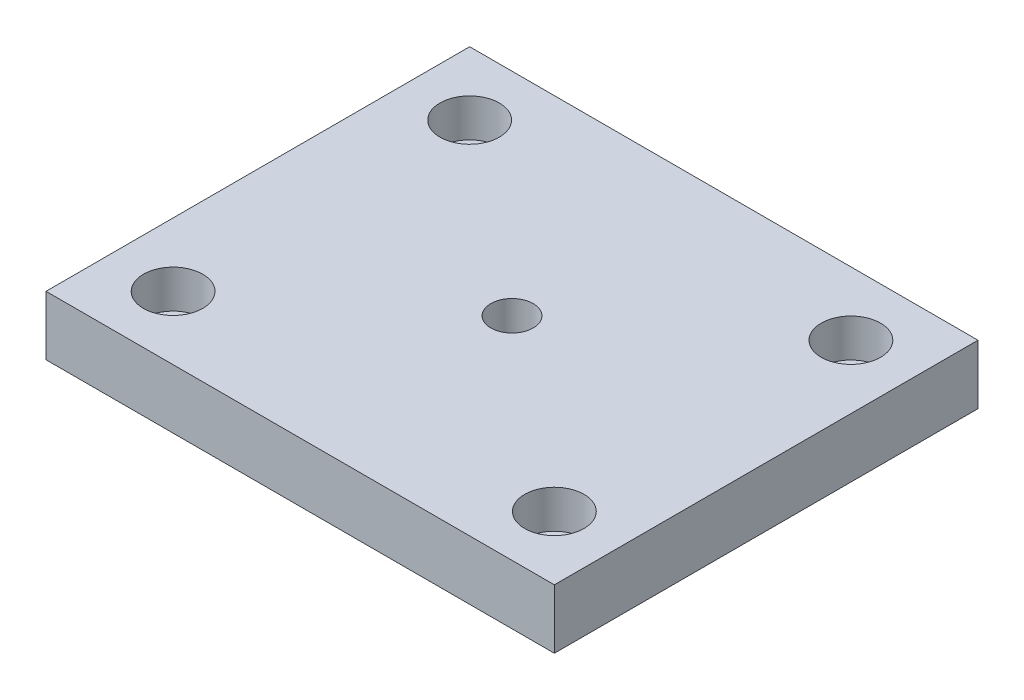
ISO-10303-21;
HEADER;
FILE_DESCRIPTION(('STEP AP214'),'2;1');
FILE_NAME('part.step','',(''),(''),'','','');
FILE_SCHEMA(('AUTOMOTIVE_DESIGN { 1 0 10303 214 1 1 1 1 }'));
ENDSEC;
DATA;
#1=APPLICATION_CONTEXT('core data for automotive mechanical design processes');
#2=APPLICATION_PROTOCOL_DEFINITION('international standard','automotive_design',2000,#1);
#3=PRODUCT_CONTEXT('',#1,'mechanical');
#4=PRODUCT('Part','Part','',(#3));
#5=PRODUCT_RELATED_PRODUCT_CATEGORY('part','',(#4));
#6=PRODUCT_DEFINITION_FORMATION('','',#4);
#7=PRODUCT_DEFINITION_CONTEXT('part definition',#1,'design');
#8=PRODUCT_DEFINITION('design','',#6,#7);
#9=PRODUCT_DEFINITION_SHAPE('','',#8);
#10=(LENGTH_UNIT() NAMED_UNIT(*) SI_UNIT(.MILLI.,.METRE.));
#11=(NAMED_UNIT(*) PLANE_ANGLE_UNIT() SI_UNIT($,.RADIAN.));
#12=(NAMED_UNIT(*) SI_UNIT($,.STERADIAN.) SOLID_ANGLE_UNIT());
#13=UNCERTAINTY_MEASURE_WITH_UNIT(LENGTH_MEASURE(1.E-05),#10,'distance_accuracy_value','');
#14=(GEOMETRIC_REPRESENTATION_CONTEXT(3) GLOBAL_UNCERTAINTY_ASSIGNED_CONTEXT((#13)) GLOBAL_UNIT_ASSIGNED_CONTEXT((#10,
#11,#12)) REPRESENTATION_CONTEXT('',''));
#15=CARTESIAN_POINT('',(0.,0.,0.));
#16=DIRECTION('',(0.,0.,1.));
#17=DIRECTION('',(1.,0.,0.));
#18=AXIS2_PLACEMENT_3D('',#15,#16,#17);
#19=CARTESIAN_POINT('',(60.,14.,-50.));
#20=DIRECTION('',(0.,-1.,0.));
#21=DIRECTION('',(0.,0.,-1.));
#22=AXIS2_PLACEMENT_3D('',#19,#20,#21);
#23=PLANE('',#22);
#24=CARTESIAN_POINT('',(-45.,14.,-35.));
#25=DIRECTION('',(0.,1.,0.));
#26=DIRECTION('',(0.,0.,1.));
#27=AXIS2_PLACEMENT_3D('',#24,#25,#26);
#28=CIRCLE('',#27,7.);
#29=CARTESIAN_POINT('',(-45.,14.,-28.));
#30=VERTEX_POINT('',#29);
#31=EDGE_CURVE('E163',#30,#30,#28,.T.);
#32=ORIENTED_EDGE('',*,*,#31,.F.);
#33=EDGE_LOOP('',(#32));
#34=FACE_BOUND('',#33,.T.);
#35=CARTESIAN_POINT('',(-45.,14.,35.));
#36=DIRECTION('',(0.,1.,0.));
#37=DIRECTION('',(0.,0.,1.));
#38=AXIS2_PLACEMENT_3D('',#35,#36,#37);
#39=CIRCLE('',#38,7.);
#40=CARTESIAN_POINT('',(-45.,14.,42.));
#41=VERTEX_POINT('',#40);
#42=EDGE_CURVE('E151',#41,#41,#39,.T.);
#43=ORIENTED_EDGE('',*,*,#42,.F.);
#44=EDGE_LOOP('',(#43));
#45=FACE_BOUND('',#44,.T.);
#46=CARTESIAN_POINT('',(45.,14.,35.));
#47=DIRECTION('',(0.,1.,0.));
#48=DIRECTION('',(0.,0.,1.));
#49=AXIS2_PLACEMENT_3D('',#46,#47,#48);
#50=CIRCLE('',#49,7.);
#51=CARTESIAN_POINT('',(45.,14.,42.));
#52=VERTEX_POINT('',#51);
#53=EDGE_CURVE('E139',#52,#52,#50,.T.);
#54=ORIENTED_EDGE('',*,*,#53,.F.);
#55=EDGE_LOOP('',(#54));
#56=FACE_BOUND('',#55,.T.);
#57=CARTESIAN_POINT('',(45.,14.,-35.));
#58=DIRECTION('',(0.,1.,0.));
#59=DIRECTION('',(0.,0.,1.));
#60=AXIS2_PLACEMENT_3D('',#57,#58,#59);
#61=CIRCLE('',#60,7.);
#62=CARTESIAN_POINT('',(45.,14.,-28.));
#63=VERTEX_POINT('',#62);
#64=EDGE_CURVE('E127',#63,#63,#61,.T.);
#65=ORIENTED_EDGE('',*,*,#64,.F.);
#66=EDGE_LOOP('',(#65));
#67=FACE_BOUND('',#66,.T.);
#68=DIRECTION('',(0.,0.,-1.));
#69=VECTOR('',#68,1.);
#70=CARTESIAN_POINT('',(60.,14.,50.));
#71=LINE('',#70,#69);
#72=CARTESIAN_POINT('',(60.,14.,50.));
#73=VERTEX_POINT('',#72);
#74=CARTESIAN_POINT('',(60.,14.,-50.));
#75=VERTEX_POINT('',#74);
#76=EDGE_CURVE('E86',#73,#75,#71,.T.);
#77=ORIENTED_EDGE('',*,*,#76,.T.);
#78=DIRECTION('',(-1.,0.,0.));
#79=VECTOR('',#78,1.);
#80=CARTESIAN_POINT('',(-60.,14.,-50.));
#81=LINE('',#80,#79);
#82=CARTESIAN_POINT('',(-60.,14.,-50.));
#83=VERTEX_POINT('',#82);
#84=EDGE_CURVE('E81',#75,#83,#81,.T.);
#85=ORIENTED_EDGE('',*,*,#84,.T.);
#86=DIRECTION('',(0.,0.,1.));
#87=VECTOR('',#86,1.);
#88=CARTESIAN_POINT('',(-60.,14.,50.));
#89=LINE('',#88,#87);
#90=CARTESIAN_POINT('',(-60.,14.,50.));
#91=VERTEX_POINT('',#90);
#92=EDGE_CURVE('E84',#83,#91,#89,.T.);
#93=ORIENTED_EDGE('',*,*,#92,.T.);
#94=DIRECTION('',(1.,0.,0.));
#95=VECTOR('',#94,1.);
#96=CARTESIAN_POINT('',(-60.,14.,50.));
#97=LINE('',#96,#95);
#98=EDGE_CURVE('E51',#91,#73,#97,.T.);
#99=ORIENTED_EDGE('',*,*,#98,.T.);
#100=EDGE_LOOP('',(#77,#85,#93,#99));
#101=FACE_BOUND('',#100,.T.);
#102=CARTESIAN_POINT('',(0.,14.,0.));
#103=DIRECTION('',(0.,1.,0.));
#104=DIRECTION('',(0.,0.,1.));
#105=AXIS2_PLACEMENT_3D('',#102,#103,#104);
#106=CIRCLE('',#105,5.);
#107=CARTESIAN_POINT('',(0.,14.,5.));
#108=VERTEX_POINT('',#107);
#109=EDGE_CURVE('E101',#108,#108,#106,.T.);
#110=ORIENTED_EDGE('',*,*,#109,.F.);
#111=EDGE_LOOP('',(#110));
#112=FACE_BOUND('',#111,.T.);
#113=ADVANCED_FACE('F34',(#34,#45,#56,#67,#101,#112),#23,.F.);
#114=CARTESIAN_POINT('',(60.,0.,-50.));
#115=DIRECTION('',(0.,-1.,0.));
#116=DIRECTION('',(0.,0.,-1.));
#117=AXIS2_PLACEMENT_3D('',#114,#115,#116);
#118=PLANE('',#117);
#119=CARTESIAN_POINT('',(-45.,0.,-35.));
#120=DIRECTION('',(0.,1.,0.));
#121=DIRECTION('',(0.,0.,1.));
#122=AXIS2_PLACEMENT_3D('',#119,#120,#121);
#123=CIRCLE('',#122,4.5);
#124=CARTESIAN_POINT('',(-45.,0.,-30.5));
#125=VERTEX_POINT('',#124);
#126=EDGE_CURVE('E154',#125,#125,#123,.T.);
#127=ORIENTED_EDGE('',*,*,#126,.T.);
#128=EDGE_LOOP('',(#127));
#129=FACE_BOUND('',#128,.T.);
#130=CARTESIAN_POINT('',(-45.,0.,35.));
#131=DIRECTION('',(0.,1.,0.));
#132=DIRECTION('',(0.,0.,1.));
#133=AXIS2_PLACEMENT_3D('',#130,#131,#132);
#134=CIRCLE('',#133,4.5);
#135=CARTESIAN_POINT('',(-45.,0.,39.5));
#136=VERTEX_POINT('',#135);
#137=EDGE_CURVE('E142',#136,#136,#134,.T.);
#138=ORIENTED_EDGE('',*,*,#137,.T.);
#139=EDGE_LOOP('',(#138));
#140=FACE_BOUND('',#139,.T.);
#141=CARTESIAN_POINT('',(45.,0.,35.));
#142=DIRECTION('',(0.,1.,0.));
#143=DIRECTION('',(0.,0.,1.));
#144=AXIS2_PLACEMENT_3D('',#141,#142,#143);
#145=CIRCLE('',#144,4.5);
#146=CARTESIAN_POINT('',(45.,0.,39.5));
#147=VERTEX_POINT('',#146);
#148=EDGE_CURVE('E130',#147,#147,#145,.T.);
#149=ORIENTED_EDGE('',*,*,#148,.T.);
#150=EDGE_LOOP('',(#149));
#151=FACE_BOUND('',#150,.T.);
#152=CARTESIAN_POINT('',(45.,0.,-35.));
#153=DIRECTION('',(0.,1.,0.));
#154=DIRECTION('',(0.,0.,1.));
#155=AXIS2_PLACEMENT_3D('',#152,#153,#154);
#156=CIRCLE('',#155,4.5);
#157=CARTESIAN_POINT('',(45.,0.,-30.5));
#158=VERTEX_POINT('',#157);
#159=EDGE_CURVE('E116',#158,#158,#156,.T.);
#160=ORIENTED_EDGE('',*,*,#159,.T.);
#161=EDGE_LOOP('',(#160));
#162=FACE_BOUND('',#161,.T.);
#163=DIRECTION('',(0.,0.,-1.));
#164=VECTOR('',#163,1.);
#165=CARTESIAN_POINT('',(60.,0.,50.));
#166=LINE('',#165,#164);
#167=CARTESIAN_POINT('',(60.,0.,50.));
#168=VERTEX_POINT('',#167);
#169=CARTESIAN_POINT('',(60.,0.,-50.));
#170=VERTEX_POINT('',#169);
#171=EDGE_CURVE('E98',#168,#170,#166,.T.);
#172=ORIENTED_EDGE('',*,*,#171,.F.);
#173=DIRECTION('',(1.,0.,0.));
#174=VECTOR('',#173,1.);
#175=CARTESIAN_POINT('',(-60.,0.,50.));
#176=LINE('',#175,#174);
#177=CARTESIAN_POINT('',(-60.,0.,50.));
#178=VERTEX_POINT('',#177);
#179=EDGE_CURVE('E74',#178,#168,#176,.T.);
#180=ORIENTED_EDGE('',*,*,#179,.F.);
#181=DIRECTION('',(0.,0.,1.));
#182=VECTOR('',#181,1.);
#183=CARTESIAN_POINT('',(-60.,0.,50.));
#184=LINE('',#183,#182);
#185=CARTESIAN_POINT('',(-60.,0.,-50.));
#186=VERTEX_POINT('',#185);
#187=EDGE_CURVE('E68',#186,#178,#184,.T.);
#188=ORIENTED_EDGE('',*,*,#187,.F.);
#189=DIRECTION('',(-1.,0.,0.));
#190=VECTOR('',#189,1.);
#191=CARTESIAN_POINT('',(-60.,0.,-50.));
#192=LINE('',#191,#190);
#193=EDGE_CURVE('E90',#170,#186,#192,.T.);
#194=ORIENTED_EDGE('',*,*,#193,.F.);
#195=EDGE_LOOP('',(#172,#180,#188,#194));
#196=FACE_BOUND('',#195,.T.);
#197=CARTESIAN_POINT('',(0.,0.,0.));
#198=DIRECTION('',(0.,1.,0.));
#199=DIRECTION('',(0.,0.,1.));
#200=AXIS2_PLACEMENT_3D('',#197,#198,#199);
#201=CIRCLE('',#200,5.);
#202=CARTESIAN_POINT('',(0.,0.,5.));
#203=VERTEX_POINT('',#202);
#204=EDGE_CURVE('E113',#203,#203,#201,.T.);
#205=ORIENTED_EDGE('',*,*,#204,.T.);
#206=EDGE_LOOP('',(#205));
#207=FACE_BOUND('',#206,.T.);
#208=ADVANCED_FACE('F109',(#129,#140,#151,#162,#196,#207),#118,.T.);
#209=CARTESIAN_POINT('',(60.,14.,50.));
#210=DIRECTION('',(-1.,0.,0.));
#211=DIRECTION('',(0.,0.,1.));
#212=AXIS2_PLACEMENT_3D('',#209,#210,#211);
#213=PLANE('',#212);
#214=ORIENTED_EDGE('',*,*,#171,.T.);
#215=DIRECTION('',(0.,-1.,0.));
#216=VECTOR('',#215,1.);
#217=CARTESIAN_POINT('',(60.,14.,-50.));
#218=LINE('',#217,#216);
#219=EDGE_CURVE('E11',#75,#170,#218,.T.);
#220=ORIENTED_EDGE('',*,*,#219,.F.);
#221=ORIENTED_EDGE('',*,*,#76,.F.);
#222=DIRECTION('',(0.,-1.,0.));
#223=VECTOR('',#222,1.);
#224=CARTESIAN_POINT('',(60.,14.,50.));
#225=LINE('',#224,#223);
#226=EDGE_CURVE('E94',#73,#168,#225,.T.);
#227=ORIENTED_EDGE('',*,*,#226,.T.);
#228=EDGE_LOOP('',(#214,#220,#221,#227));
#229=FACE_BOUND('',#228,.T.);
#230=ADVANCED_FACE('F36',(#229),#213,.F.);
#231=CARTESIAN_POINT('',(-60.,14.,-50.));
#232=DIRECTION('',(0.,0.,1.));
#233=DIRECTION('',(1.,0.,0.));
#234=AXIS2_PLACEMENT_3D('',#231,#232,#233);
#235=PLANE('',#234);
#236=ORIENTED_EDGE('',*,*,#193,.T.);
#237=DIRECTION('',(0.,-1.,0.));
#238=VECTOR('',#237,1.);
#239=CARTESIAN_POINT('',(-60.,14.,-50.));
#240=LINE('',#239,#238);
#241=EDGE_CURVE('E43',#83,#186,#240,.T.);
#242=ORIENTED_EDGE('',*,*,#241,.F.);
#243=ORIENTED_EDGE('',*,*,#84,.F.);
#244=ORIENTED_EDGE('',*,*,#219,.T.);
#245=EDGE_LOOP('',(#236,#242,#243,#244));
#246=FACE_BOUND('',#245,.T.);
#247=ADVANCED_FACE('F89',(#246),#235,.F.);
#248=CARTESIAN_POINT('',(-60.,14.,50.));
#249=DIRECTION('',(1.,0.,0.));
#250=DIRECTION('',(0.,0.,-1.));
#251=AXIS2_PLACEMENT_3D('',#248,#249,#250);
#252=PLANE('',#251);
#253=ORIENTED_EDGE('',*,*,#187,.T.);
#254=DIRECTION('',(0.,-1.,0.));
#255=VECTOR('',#254,1.);
#256=CARTESIAN_POINT('',(-60.,14.,50.));
#257=LINE('',#256,#255);
#258=EDGE_CURVE('E91',#91,#178,#257,.T.);
#259=ORIENTED_EDGE('',*,*,#258,.F.);
#260=ORIENTED_EDGE('',*,*,#92,.F.);
#261=ORIENTED_EDGE('',*,*,#241,.T.);
#262=EDGE_LOOP('',(#253,#259,#260,#261));
#263=FACE_BOUND('',#262,.T.);
#264=ADVANCED_FACE('F92',(#263),#252,.F.);
#265=CARTESIAN_POINT('',(-60.,14.,50.));
#266=DIRECTION('',(0.,0.,-1.));
#267=DIRECTION('',(-1.,0.,0.));
#268=AXIS2_PLACEMENT_3D('',#265,#266,#267);
#269=PLANE('',#268);
#270=ORIENTED_EDGE('',*,*,#179,.T.);
#271=ORIENTED_EDGE('',*,*,#226,.F.);
#272=ORIENTED_EDGE('',*,*,#98,.F.);
#273=ORIENTED_EDGE('',*,*,#258,.T.);
#274=EDGE_LOOP('',(#270,#271,#272,#273));
#275=FACE_BOUND('',#274,.T.);
#276=ADVANCED_FACE('F106',(#275),#269,.F.);
#277=CARTESIAN_POINT('',(0.,14.,0.));
#278=DIRECTION('',(0.,-1.,0.));
#279=DIRECTION('',(0.,0.,-1.));
#280=AXIS2_PLACEMENT_3D('',#277,#278,#279);
#281=CYLINDRICAL_SURFACE('',#280,5.);
#282=ORIENTED_EDGE('',*,*,#109,.T.);
#283=EDGE_LOOP('',(#282));
#284=FACE_BOUND('',#283,.T.);
#285=ORIENTED_EDGE('',*,*,#204,.F.);
#286=EDGE_LOOP('',(#285));
#287=FACE_BOUND('',#286,.T.);
#288=ADVANCED_FACE('F199',(#284,#287),#281,.F.);
#289=CARTESIAN_POINT('',(45.,14.,-35.));
#290=DIRECTION('',(0.,1.,0.));
#291=DIRECTION('',(0.,0.,1.));
#292=AXIS2_PLACEMENT_3D('',#289,#290,#291);
#293=CYLINDRICAL_SURFACE('',#292,4.5);
#294=ORIENTED_EDGE('',*,*,#159,.F.);
#295=EDGE_LOOP('',(#294));
#296=FACE_BOUND('',#295,.T.);
#297=CARTESIAN_POINT('',(45.,5.,-35.));
#298=DIRECTION('',(0.,1.,0.));
#299=DIRECTION('',(0.,0.,1.));
#300=AXIS2_PLACEMENT_3D('',#297,#298,#299);
#301=CIRCLE('',#300,4.5);
#302=CARTESIAN_POINT('',(45.,5.,-30.5));
#303=VERTEX_POINT('',#302);
#304=EDGE_CURVE('E121',#303,#303,#301,.T.);
#305=ORIENTED_EDGE('',*,*,#304,.T.);
#306=EDGE_LOOP('',(#305));
#307=FACE_BOUND('',#306,.T.);
#308=ADVANCED_FACE('F191',(#296,#307),#293,.F.);
#309=CARTESIAN_POINT('',(49.5,5.,-35.));
#310=DIRECTION('',(0.,-1.,0.));
#311=DIRECTION('',(0.,0.,-1.));
#312=AXIS2_PLACEMENT_3D('',#309,#310,#311);
#313=PLANE('',#312);
#314=ORIENTED_EDGE('',*,*,#304,.F.);
#315=EDGE_LOOP('',(#314));
#316=FACE_BOUND('',#315,.T.);
#317=CARTESIAN_POINT('',(45.,5.,-35.));
#318=DIRECTION('',(0.,1.,0.));
#319=DIRECTION('',(0.,0.,1.));
#320=AXIS2_PLACEMENT_3D('',#317,#318,#319);
#321=CIRCLE('',#320,7.);
#322=CARTESIAN_POINT('',(45.,5.,-28.));
#323=VERTEX_POINT('',#322);
#324=EDGE_CURVE('E124',#323,#323,#321,.T.);
#325=ORIENTED_EDGE('',*,*,#324,.T.);
#326=EDGE_LOOP('',(#325));
#327=FACE_BOUND('',#326,.T.);
#328=ADVANCED_FACE('F181',(#316,#327),#313,.F.);
#329=CARTESIAN_POINT('',(45.,14.,-35.));
#330=DIRECTION('',(0.,1.,0.));
#331=DIRECTION('',(0.,0.,1.));
#332=AXIS2_PLACEMENT_3D('',#329,#330,#331);
#333=CYLINDRICAL_SURFACE('',#332,7.);
#334=ORIENTED_EDGE('',*,*,#324,.F.);
#335=EDGE_LOOP('',(#334));
#336=FACE_BOUND('',#335,.T.);
#337=ORIENTED_EDGE('',*,*,#64,.T.);
#338=EDGE_LOOP('',(#337));
#339=FACE_BOUND('',#338,.T.);
#340=ADVANCED_FACE('F178',(#336,#339),#333,.F.);
#341=CARTESIAN_POINT('',(45.,14.,35.));
#342=DIRECTION('',(0.,1.,0.));
#343=DIRECTION('',(0.,0.,1.));
#344=AXIS2_PLACEMENT_3D('',#341,#342,#343);
#345=CYLINDRICAL_SURFACE('',#344,4.5);
#346=ORIENTED_EDGE('',*,*,#148,.F.);
#347=EDGE_LOOP('',(#346));
#348=FACE_BOUND('',#347,.T.);
#349=CARTESIAN_POINT('',(45.,5.,35.));
#350=DIRECTION('',(0.,1.,0.));
#351=DIRECTION('',(0.,0.,1.));
#352=AXIS2_PLACEMENT_3D('',#349,#350,#351);
#353=CIRCLE('',#352,4.5);
#354=CARTESIAN_POINT('',(45.,5.,39.5));
#355=VERTEX_POINT('',#354);
#356=EDGE_CURVE('E133',#355,#355,#353,.T.);
#357=ORIENTED_EDGE('',*,*,#356,.T.);
#358=EDGE_LOOP('',(#357));
#359=FACE_BOUND('',#358,.T.);
#360=ADVANCED_FACE('F180',(#348,#359),#345,.F.);
#361=CARTESIAN_POINT('',(49.5,5.,35.));
#362=DIRECTION('',(0.,-1.,0.));
#363=DIRECTION('',(0.,0.,-1.));
#364=AXIS2_PLACEMENT_3D('',#361,#362,#363);
#365=PLANE('',#364);
#366=ORIENTED_EDGE('',*,*,#356,.F.);
#367=EDGE_LOOP('',(#366));
#368=FACE_BOUND('',#367,.T.);
#369=CARTESIAN_POINT('',(45.,5.,35.));
#370=DIRECTION('',(0.,1.,0.));
#371=DIRECTION('',(0.,0.,1.));
#372=AXIS2_PLACEMENT_3D('',#369,#370,#371);
#373=CIRCLE('',#372,7.);
#374=CARTESIAN_POINT('',(45.,5.,42.));
#375=VERTEX_POINT('',#374);
#376=EDGE_CURVE('E136',#375,#375,#373,.T.);
#377=ORIENTED_EDGE('',*,*,#376,.T.);
#378=EDGE_LOOP('',(#377));
#379=FACE_BOUND('',#378,.T.);
#380=ADVANCED_FACE('F188',(#368,#379),#365,.F.);
#381=CARTESIAN_POINT('',(45.,14.,35.));
#382=DIRECTION('',(0.,1.,0.));
#383=DIRECTION('',(0.,0.,1.));
#384=AXIS2_PLACEMENT_3D('',#381,#382,#383);
#385=CYLINDRICAL_SURFACE('',#384,7.);
#386=ORIENTED_EDGE('',*,*,#376,.F.);
#387=EDGE_LOOP('',(#386));
#388=FACE_BOUND('',#387,.T.);
#389=ORIENTED_EDGE('',*,*,#53,.T.);
#390=EDGE_LOOP('',(#389));
#391=FACE_BOUND('',#390,.T.);
#392=ADVANCED_FACE('F279',(#388,#391),#385,.F.);
#393=CARTESIAN_POINT('',(-45.,14.,35.));
#394=DIRECTION('',(0.,1.,0.));
#395=DIRECTION('',(0.,0.,1.));
#396=AXIS2_PLACEMENT_3D('',#393,#394,#395);
#397=CYLINDRICAL_SURFACE('',#396,4.5);
#398=ORIENTED_EDGE('',*,*,#137,.F.);
#399=EDGE_LOOP('',(#398));
#400=FACE_BOUND('',#399,.T.);
#401=CARTESIAN_POINT('',(-45.,5.,35.));
#402=DIRECTION('',(0.,1.,0.));
#403=DIRECTION('',(0.,0.,1.));
#404=AXIS2_PLACEMENT_3D('',#401,#402,#403);
#405=CIRCLE('',#404,4.5);
#406=CARTESIAN_POINT('',(-45.,5.,39.5));
#407=VERTEX_POINT('',#406);
#408=EDGE_CURVE('E145',#407,#407,#405,.T.);
#409=ORIENTED_EDGE('',*,*,#408,.T.);
#410=EDGE_LOOP('',(#409));
#411=FACE_BOUND('',#410,.T.);
#412=ADVANCED_FACE('F288',(#400,#411),#397,.F.);
#413=CARTESIAN_POINT('',(-40.5,5.,35.));
#414=DIRECTION('',(0.,-1.,0.));
#415=DIRECTION('',(0.,0.,-1.));
#416=AXIS2_PLACEMENT_3D('',#413,#414,#415);
#417=PLANE('',#416);
#418=ORIENTED_EDGE('',*,*,#408,.F.);
#419=EDGE_LOOP('',(#418));
#420=FACE_BOUND('',#419,.T.);
#421=CARTESIAN_POINT('',(-45.,5.,35.));
#422=DIRECTION('',(0.,1.,0.));
#423=DIRECTION('',(0.,0.,1.));
#424=AXIS2_PLACEMENT_3D('',#421,#422,#423);
#425=CIRCLE('',#424,7.);
#426=CARTESIAN_POINT('',(-45.,5.,42.));
#427=VERTEX_POINT('',#426);
#428=EDGE_CURVE('E148',#427,#427,#425,.T.);
#429=ORIENTED_EDGE('',*,*,#428,.T.);
#430=EDGE_LOOP('',(#429));
#431=FACE_BOUND('',#430,.T.);
#432=ADVANCED_FACE('F298',(#420,#431),#417,.F.);
#433=CARTESIAN_POINT('',(-45.,14.,35.));
#434=DIRECTION('',(0.,1.,0.));
#435=DIRECTION('',(0.,0.,1.));
#436=AXIS2_PLACEMENT_3D('',#433,#434,#435);
#437=CYLINDRICAL_SURFACE('',#436,7.);
#438=ORIENTED_EDGE('',*,*,#428,.F.);
#439=EDGE_LOOP('',(#438));
#440=FACE_BOUND('',#439,.T.);
#441=ORIENTED_EDGE('',*,*,#42,.T.);
#442=EDGE_LOOP('',(#441));
#443=FACE_BOUND('',#442,.T.);
#444=ADVANCED_FACE('F308',(#440,#443),#437,.F.);
#445=CARTESIAN_POINT('',(-45.,14.,-35.));
#446=DIRECTION('',(0.,1.,0.));
#447=DIRECTION('',(0.,0.,1.));
#448=AXIS2_PLACEMENT_3D('',#445,#446,#447);
#449=CYLINDRICAL_SURFACE('',#448,4.5);
#450=ORIENTED_EDGE('',*,*,#126,.F.);
#451=EDGE_LOOP('',(#450));
#452=FACE_BOUND('',#451,.T.);
#453=CARTESIAN_POINT('',(-45.,5.,-35.));
#454=DIRECTION('',(0.,1.,0.));
#455=DIRECTION('',(0.,0.,1.));
#456=AXIS2_PLACEMENT_3D('',#453,#454,#455);
#457=CIRCLE('',#456,4.5);
#458=CARTESIAN_POINT('',(-45.,5.,-30.5));
#459=VERTEX_POINT('',#458);
#460=EDGE_CURVE('E157',#459,#459,#457,.T.);
#461=ORIENTED_EDGE('',*,*,#460,.T.);
#462=EDGE_LOOP('',(#461));
#463=FACE_BOUND('',#462,.T.);
#464=ADVANCED_FACE('F318',(#452,#463),#449,.F.);
#465=CARTESIAN_POINT('',(-40.5,5.,-35.));
#466=DIRECTION('',(0.,-1.,0.));
#467=DIRECTION('',(0.,0.,-1.));
#468=AXIS2_PLACEMENT_3D('',#465,#466,#467);
#469=PLANE('',#468);
#470=ORIENTED_EDGE('',*,*,#460,.F.);
#471=EDGE_LOOP('',(#470));
#472=FACE_BOUND('',#471,.T.);
#473=CARTESIAN_POINT('',(-45.,5.,-35.));
#474=DIRECTION('',(0.,1.,0.));
#475=DIRECTION('',(0.,0.,1.));
#476=AXIS2_PLACEMENT_3D('',#473,#474,#475);
#477=CIRCLE('',#476,7.);
#478=CARTESIAN_POINT('',(-45.,5.,-28.));
#479=VERTEX_POINT('',#478);
#480=EDGE_CURVE('E160',#479,#479,#477,.T.);
#481=ORIENTED_EDGE('',*,*,#480,.T.);
#482=EDGE_LOOP('',(#481));
#483=FACE_BOUND('',#482,.T.);
#484=ADVANCED_FACE('F328',(#472,#483),#469,.F.);
#485=CARTESIAN_POINT('',(-45.,14.,-35.));
#486=DIRECTION('',(0.,1.,0.));
#487=DIRECTION('',(0.,0.,1.));
#488=AXIS2_PLACEMENT_3D('',#485,#486,#487);
#489=CYLINDRICAL_SURFACE('',#488,7.);
#490=ORIENTED_EDGE('',*,*,#480,.F.);
#491=EDGE_LOOP('',(#490));
#492=FACE_BOUND('',#491,.T.);
#493=ORIENTED_EDGE('',*,*,#31,.T.);
#494=EDGE_LOOP('',(#493));
#495=FACE_BOUND('',#494,.T.);
#496=ADVANCED_FACE('F167',(#492,#495),#489,.F.);
#497=CLOSED_SHELL('',(#113,#208,#230,#247,#264,#276,#288,#308,#328,#340,#360,#380,#392,#412,
#432,#444,#464,#484,#496));
#498=MANIFOLD_SOLID_BREP('B2',#497);
#499=ADVANCED_BREP_SHAPE_REPRESENTATION('',(#18,#498),#14);
#500=SHAPE_DEFINITION_REPRESENTATION(#9,#499);
ENDSEC;
END-ISO-10303-21;
